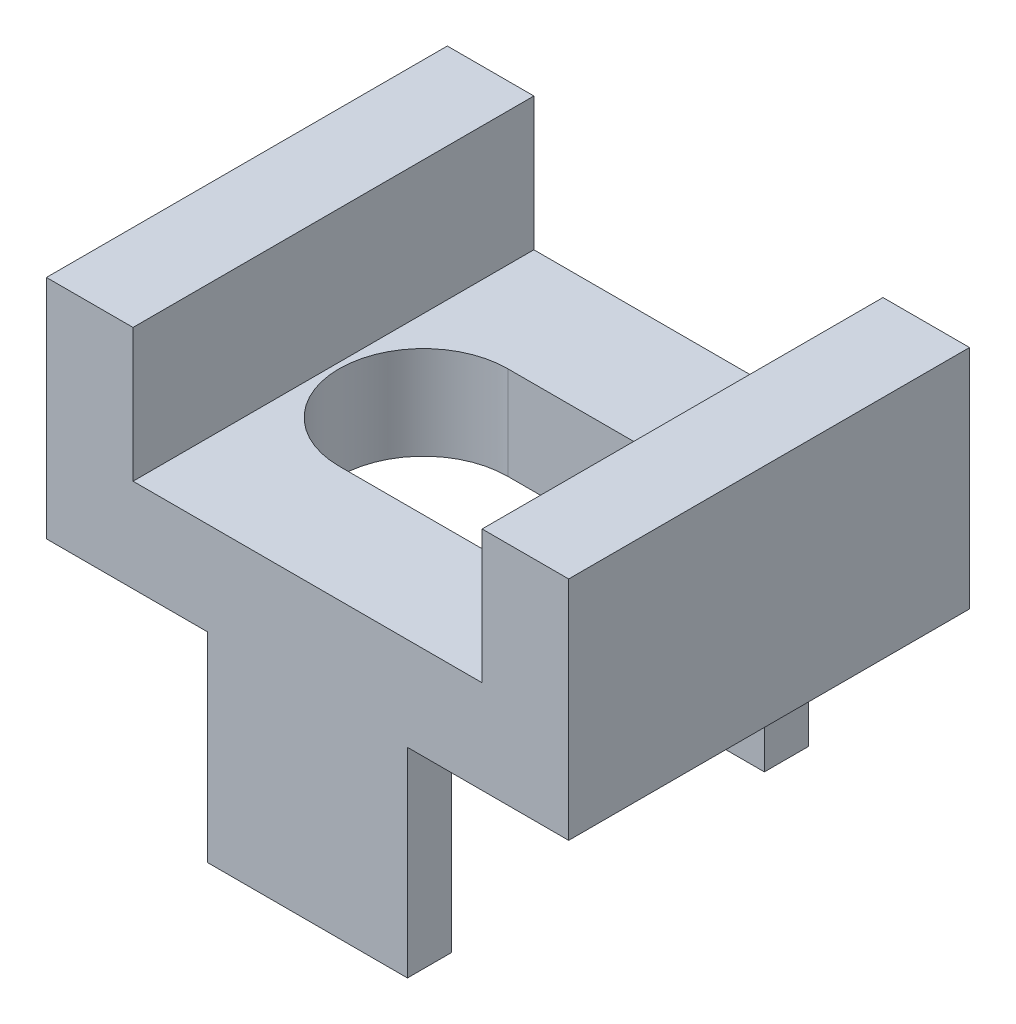
ISO-10303-21;
HEADER;
FILE_DESCRIPTION(('STEP AP214'),'2;1');
FILE_NAME('part.step','',(''),(''),'','','');
FILE_SCHEMA(('AUTOMOTIVE_DESIGN { 1 0 10303 214 1 1 1 1 }'));
ENDSEC;
DATA;
#1=APPLICATION_CONTEXT('core data for automotive mechanical design processes');
#2=APPLICATION_PROTOCOL_DEFINITION('international standard','automotive_design',2000,#1);
#3=PRODUCT_CONTEXT('',#1,'mechanical');
#4=PRODUCT('Part','Part','',(#3));
#5=PRODUCT_RELATED_PRODUCT_CATEGORY('part','',(#4));
#6=PRODUCT_DEFINITION_FORMATION('','',#4);
#7=PRODUCT_DEFINITION_CONTEXT('part definition',#1,'design');
#8=PRODUCT_DEFINITION('design','',#6,#7);
#9=PRODUCT_DEFINITION_SHAPE('','',#8);
#10=(LENGTH_UNIT() NAMED_UNIT(*) SI_UNIT(.MILLI.,.METRE.));
#11=(NAMED_UNIT(*) PLANE_ANGLE_UNIT() SI_UNIT($,.RADIAN.));
#12=(NAMED_UNIT(*) SI_UNIT($,.STERADIAN.) SOLID_ANGLE_UNIT());
#13=UNCERTAINTY_MEASURE_WITH_UNIT(LENGTH_MEASURE(1.E-05),#10,'distance_accuracy_value','');
#14=(GEOMETRIC_REPRESENTATION_CONTEXT(3) GLOBAL_UNCERTAINTY_ASSIGNED_CONTEXT((#13)) GLOBAL_UNIT_ASSIGNED_CONTEXT((#10,
#11,#12)) REPRESENTATION_CONTEXT('',''));
#15=CARTESIAN_POINT('',(0.,0.,0.));
#16=DIRECTION('',(0.,0.,1.));
#17=DIRECTION('',(1.,0.,0.));
#18=AXIS2_PLACEMENT_3D('',#15,#16,#17);
#19=CARTESIAN_POINT('',(0.,15.9179465383006,0.));
#20=DIRECTION('',(0.,-1.,0.));
#21=DIRECTION('',(0.,0.,-1.));
#22=AXIS2_PLACEMENT_3D('',#19,#20,#21);
#23=PLANE('',#22);
#24=CARTESIAN_POINT('',(-29.7422861966929,15.9179465383006,1.76446459703365));
#25=DIRECTION('',(0.,1.,0.));
#26=DIRECTION('',(-1.,0.,0.));
#27=AXIS2_PLACEMENT_3D('',#24,#25,#26);
#28=CIRCLE('',#27,0.633400000000021);
#29=CARTESIAN_POINT('',(-29.7422861966929,15.9179465383006,1.13106459703361));
#30=VERTEX_POINT('',#29);
#31=CARTESIAN_POINT('',(-29.7422861966929,15.9179465383006,2.39786459703365));
#32=VERTEX_POINT('',#31);
#33=EDGE_CURVE('E287',#30,#32,#28,.T.);
#34=ORIENTED_EDGE('',*,*,#33,.F.);
#35=DIRECTION('',(-1.,0.,0.));
#36=VECTOR('',#35,1.);
#37=CARTESIAN_POINT('',(-29.7422861966929,15.9179465383006,1.13106459703361));
#38=LINE('',#37,#36);
#39=CARTESIAN_POINT('',(-28.4722861966929,15.9179465383006,1.13106459703361));
#40=VERTEX_POINT('',#39);
#41=EDGE_CURVE('E295',#40,#30,#38,.T.);
#42=ORIENTED_EDGE('',*,*,#41,.F.);
#43=CARTESIAN_POINT('',(-28.4722861966929,15.9179465383006,1.76446459703363));
#44=DIRECTION('',(0.,1.,0.));
#45=DIRECTION('',(-1.,0.,0.));
#46=AXIS2_PLACEMENT_3D('',#43,#44,#45);
#47=CIRCLE('',#46,0.633400000000021);
#48=CARTESIAN_POINT('',(-28.4722861966929,15.9179465383006,2.39786459703365));
#49=VERTEX_POINT('',#48);
#50=EDGE_CURVE('E292',#49,#40,#47,.T.);
#51=ORIENTED_EDGE('',*,*,#50,.F.);
#52=DIRECTION('',(1.,0.,0.));
#53=VECTOR('',#52,1.);
#54=CARTESIAN_POINT('',(-29.7422861966929,15.9179465383006,2.39786459703365));
#55=LINE('',#54,#53);
#56=EDGE_CURVE('E289',#32,#49,#55,.T.);
#57=ORIENTED_EDGE('',*,*,#56,.F.);
#58=EDGE_LOOP('',(#34,#42,#51,#57));
#59=FACE_BOUND('',#58,.T.);
#60=DIRECTION('',(-1.,0.,0.));
#61=VECTOR('',#60,1.);
#62=CARTESIAN_POINT('',(-31.0677861966929,15.9179465383006,0.259564597033629));
#63=LINE('',#62,#61);
#64=CARTESIAN_POINT('',(-27.7967861966929,15.9179465383006,0.259564597033629));
#65=VERTEX_POINT('',#64);
#66=CARTESIAN_POINT('',(-30.4177861966929,15.9179465383006,0.259564597033629));
#67=VERTEX_POINT('',#66);
#68=EDGE_CURVE('E57',#65,#67,#63,.T.);
#69=ORIENTED_EDGE('',*,*,#68,.T.);
#70=DIRECTION('',(0.,0.,1.));
#71=VECTOR('',#70,1.);
#72=CARTESIAN_POINT('',(-30.4177861966929,15.9179465383006,0.259564597033629));
#73=LINE('',#72,#71);
#74=CARTESIAN_POINT('',(-30.4177861966929,15.9179465383006,3.26936459703363));
#75=VERTEX_POINT('',#74);
#76=EDGE_CURVE('E52',#67,#75,#73,.T.);
#77=ORIENTED_EDGE('',*,*,#76,.T.);
#78=DIRECTION('',(1.,0.,0.));
#79=VECTOR('',#78,1.);
#80=CARTESIAN_POINT('',(-31.0677861966929,15.9179465383006,3.26936459703363));
#81=LINE('',#80,#79);
#82=CARTESIAN_POINT('',(-27.7967861966929,15.9179465383006,3.26936459703363));
#83=VERTEX_POINT('',#82);
#84=EDGE_CURVE('E318',#75,#83,#81,.T.);
#85=ORIENTED_EDGE('',*,*,#84,.T.);
#86=DIRECTION('',(0.,0.,1.));
#87=VECTOR('',#86,1.);
#88=CARTESIAN_POINT('',(-27.7967861966929,15.9179465383006,0.259564597033629));
#89=LINE('',#88,#87);
#90=EDGE_CURVE('E206',#65,#83,#89,.T.);
#91=ORIENTED_EDGE('',*,*,#90,.F.);
#92=EDGE_LOOP('',(#69,#77,#85,#91));
#93=FACE_BOUND('',#92,.T.);
#94=ADVANCED_FACE('F37',(#59,#93),#23,.F.);
#95=CARTESIAN_POINT('',(0.,15.2179465383006,0.));
#96=DIRECTION('',(0.,-1.,0.));
#97=DIRECTION('',(0.,0.,-1.));
#98=AXIS2_PLACEMENT_3D('',#95,#96,#97);
#99=PLANE('',#98);
#100=DIRECTION('',(1.,0.,0.));
#101=VECTOR('',#100,1.);
#102=CARTESIAN_POINT('',(-29.1072861966929,15.2179465383006,2.93936459703363));
#103=LINE('',#102,#101);
#104=CARTESIAN_POINT('',(-29.8572861966929,15.2179465383006,2.93936459703363));
#105=VERTEX_POINT('',#104);
#106=CARTESIAN_POINT('',(-28.3572861966929,15.2179465383006,2.93936459703363));
#107=VERTEX_POINT('',#106);
#108=EDGE_CURVE('E266',#105,#107,#103,.T.);
#109=ORIENTED_EDGE('',*,*,#108,.F.);
#110=DIRECTION('',(0.,0.,1.));
#111=VECTOR('',#110,1.);
#112=CARTESIAN_POINT('',(-29.8572861966929,15.2179465383006,2.93936459703363));
#113=LINE('',#112,#111);
#114=CARTESIAN_POINT('',(-29.8572861966929,15.2179465383006,3.26936459703363));
#115=VERTEX_POINT('',#114);
#116=EDGE_CURVE('E226',#105,#115,#113,.T.);
#117=ORIENTED_EDGE('',*,*,#116,.T.);
#118=DIRECTION('',(1.,0.,0.));
#119=VECTOR('',#118,1.);
#120=CARTESIAN_POINT('',(-31.0677861966929,15.2179465383006,3.26936459703363));
#121=LINE('',#120,#119);
#122=CARTESIAN_POINT('',(-31.0677861966929,15.2179465383006,3.26936459703363));
#123=VERTEX_POINT('',#122);
#124=EDGE_CURVE('E322',#123,#115,#121,.T.);
#125=ORIENTED_EDGE('',*,*,#124,.F.);
#126=DIRECTION('',(0.,0.,1.));
#127=VECTOR('',#126,1.);
#128=CARTESIAN_POINT('',(-31.0677861966929,15.2179465383006,0.259564597033629));
#129=LINE('',#128,#127);
#130=CARTESIAN_POINT('',(-31.0677861966929,15.2179465383006,0.259564597033629));
#131=VERTEX_POINT('',#130);
#132=EDGE_CURVE('E320',#131,#123,#129,.T.);
#133=ORIENTED_EDGE('',*,*,#132,.F.);
#134=DIRECTION('',(-1.,0.,0.));
#135=VECTOR('',#134,1.);
#136=CARTESIAN_POINT('',(-31.0677861966929,15.2179465383006,0.259564597033629));
#137=LINE('',#136,#135);
#138=CARTESIAN_POINT('',(-29.8572861966929,15.2179465383006,0.259564597033629));
#139=VERTEX_POINT('',#138);
#140=EDGE_CURVE('E180',#139,#131,#137,.T.);
#141=ORIENTED_EDGE('',*,*,#140,.F.);
#142=DIRECTION('',(0.,0.,-1.));
#143=VECTOR('',#142,1.);
#144=CARTESIAN_POINT('',(-29.8572861966929,15.2179465383006,0.589564597033626));
#145=LINE('',#144,#143);
#146=CARTESIAN_POINT('',(-29.8572861966929,15.2179465383006,0.589564597033626));
#147=VERTEX_POINT('',#146);
#148=EDGE_CURVE('E237',#147,#139,#145,.T.);
#149=ORIENTED_EDGE('',*,*,#148,.F.);
#150=DIRECTION('',(1.,0.,0.));
#151=VECTOR('',#150,1.);
#152=CARTESIAN_POINT('',(-29.1072861966929,15.2179465383006,0.589564597033626));
#153=LINE('',#152,#151);
#154=CARTESIAN_POINT('',(-28.3572861966929,15.2179465383006,0.589564597033626));
#155=VERTEX_POINT('',#154);
#156=EDGE_CURVE('E248',#147,#155,#153,.T.);
#157=ORIENTED_EDGE('',*,*,#156,.T.);
#158=DIRECTION('',(0.,0.,-1.));
#159=VECTOR('',#158,1.);
#160=CARTESIAN_POINT('',(-28.3572861966929,15.2179465383006,0.589564597033626));
#161=LINE('',#160,#159);
#162=CARTESIAN_POINT('',(-28.3572861966929,15.2179465383006,0.259564597033629));
#163=VERTEX_POINT('',#162);
#164=EDGE_CURVE('E253',#155,#163,#161,.T.);
#165=ORIENTED_EDGE('',*,*,#164,.T.);
#166=CARTESIAN_POINT('',(-27.1467861966929,15.2179465383006,0.259564597033629));
#167=VERTEX_POINT('',#166);
#168=EDGE_CURVE('E327',#167,#163,#137,.T.);
#169=ORIENTED_EDGE('',*,*,#168,.F.);
#170=DIRECTION('',(0.,0.,-1.));
#171=VECTOR('',#170,1.);
#172=CARTESIAN_POINT('',(-27.1467861966929,15.2179465383006,0.259564597033629));
#173=LINE('',#172,#171);
#174=CARTESIAN_POINT('',(-27.1467861966929,15.2179465383006,3.26936459703363));
#175=VERTEX_POINT('',#174);
#176=EDGE_CURVE('E325',#175,#167,#173,.T.);
#177=ORIENTED_EDGE('',*,*,#176,.F.);
#178=CARTESIAN_POINT('',(-28.3572861966929,15.2179465383006,3.26936459703363));
#179=VERTEX_POINT('',#178);
#180=EDGE_CURVE('E317',#179,#175,#121,.T.);
#181=ORIENTED_EDGE('',*,*,#180,.F.);
#182=DIRECTION('',(0.,0.,1.));
#183=VECTOR('',#182,1.);
#184=CARTESIAN_POINT('',(-28.3572861966929,15.2179465383006,2.93936459703363));
#185=LINE('',#184,#183);
#186=EDGE_CURVE('E271',#107,#179,#185,.T.);
#187=ORIENTED_EDGE('',*,*,#186,.F.);
#188=EDGE_LOOP('',(#109,#117,#125,#133,#141,#149,#157,#165,#169,#177,#181,#187));
#189=FACE_BOUND('',#188,.T.);
#190=DIRECTION('',(-1.,0.,0.));
#191=VECTOR('',#190,1.);
#192=CARTESIAN_POINT('',(-29.7422861966929,15.2179465383006,1.13106459703361));
#193=LINE('',#192,#191);
#194=CARTESIAN_POINT('',(-28.4722861966929,15.2179465383006,1.13106459703361));
#195=VERTEX_POINT('',#194);
#196=CARTESIAN_POINT('',(-29.7422861966929,15.2179465383006,1.13106459703361));
#197=VERTEX_POINT('',#196);
#198=EDGE_CURVE('E290',#195,#197,#193,.T.);
#199=ORIENTED_EDGE('',*,*,#198,.T.);
#200=CARTESIAN_POINT('',(-29.7422861966929,15.2179465383006,1.76446459703365));
#201=DIRECTION('',(0.,1.,0.));
#202=DIRECTION('',(-1.,0.,0.));
#203=AXIS2_PLACEMENT_3D('',#200,#201,#202);
#204=CIRCLE('',#203,0.633400000000021);
#205=CARTESIAN_POINT('',(-29.7422861966929,15.2179465383006,2.39786459703365));
#206=VERTEX_POINT('',#205);
#207=EDGE_CURVE('E286',#197,#206,#204,.T.);
#208=ORIENTED_EDGE('',*,*,#207,.T.);
#209=DIRECTION('',(1.,0.,0.));
#210=VECTOR('',#209,1.);
#211=CARTESIAN_POINT('',(-29.7422861966929,15.2179465383006,2.39786459703365));
#212=LINE('',#211,#210);
#213=CARTESIAN_POINT('',(-28.4722861966929,15.2179465383006,2.39786459703365));
#214=VERTEX_POINT('',#213);
#215=EDGE_CURVE('E300',#206,#214,#212,.T.);
#216=ORIENTED_EDGE('',*,*,#215,.T.);
#217=CARTESIAN_POINT('',(-28.4722861966929,15.2179465383006,1.76446459703363));
#218=DIRECTION('',(0.,1.,0.));
#219=DIRECTION('',(-1.,0.,0.));
#220=AXIS2_PLACEMENT_3D('',#217,#218,#219);
#221=CIRCLE('',#220,0.633400000000021);
#222=EDGE_CURVE('E303',#214,#195,#221,.T.);
#223=ORIENTED_EDGE('',*,*,#222,.T.);
#224=EDGE_LOOP('',(#199,#208,#216,#223));
#225=FACE_BOUND('',#224,.T.);
#226=ADVANCED_FACE('F340',(#189,#225),#99,.T.);
#227=CARTESIAN_POINT('',(-31.0677861966929,15.9179465383006,3.26936459703363));
#228=DIRECTION('',(0.,0.,-1.));
#229=DIRECTION('',(0.,1.,0.));
#230=AXIS2_PLACEMENT_3D('',#227,#228,#229);
#231=PLANE('',#230);
#232=ORIENTED_EDGE('',*,*,#124,.T.);
#233=DIRECTION('',(0.,1.,0.));
#234=VECTOR('',#233,1.);
#235=CARTESIAN_POINT('',(-29.8572861966929,13.7179465383006,3.26936459703363));
#236=LINE('',#235,#234);
#237=CARTESIAN_POINT('',(-29.8572861966929,13.7179465383006,3.26936459703363));
#238=VERTEX_POINT('',#237);
#239=EDGE_CURVE('E234',#238,#115,#236,.T.);
#240=ORIENTED_EDGE('',*,*,#239,.F.);
#241=DIRECTION('',(1.,0.,0.));
#242=VECTOR('',#241,1.);
#243=CARTESIAN_POINT('',(-29.1072861966929,13.7179465383006,3.26936459703363));
#244=LINE('',#243,#242);
#245=CARTESIAN_POINT('',(-28.3572861966929,13.7179465383006,3.26936459703363));
#246=VERTEX_POINT('',#245);
#247=EDGE_CURVE('E273',#238,#246,#244,.T.);
#248=ORIENTED_EDGE('',*,*,#247,.T.);
#249=DIRECTION('',(0.,1.,0.));
#250=VECTOR('',#249,1.);
#251=CARTESIAN_POINT('',(-28.3572861966929,13.7179465383006,3.26936459703363));
#252=LINE('',#251,#250);
#253=EDGE_CURVE('E276',#246,#179,#252,.T.);
#254=ORIENTED_EDGE('',*,*,#253,.T.);
#255=ORIENTED_EDGE('',*,*,#180,.T.);
#256=DIRECTION('',(0.,-1.,0.));
#257=VECTOR('',#256,1.);
#258=CARTESIAN_POINT('',(-27.1467861966929,15.9179465383006,3.26936459703363));
#259=LINE('',#258,#257);
#260=CARTESIAN_POINT('',(-27.1467861966929,16.9179465383006,3.26936459703363));
#261=VERTEX_POINT('',#260);
#262=EDGE_CURVE('E11',#261,#175,#259,.T.);
#263=ORIENTED_EDGE('',*,*,#262,.F.);
#264=DIRECTION('',(-1.,0.,0.));
#265=VECTOR('',#264,1.);
#266=CARTESIAN_POINT('',(-27.1467861966929,16.9179465383006,3.26936459703363));
#267=LINE('',#266,#265);
#268=CARTESIAN_POINT('',(-27.7967861966929,16.9179465383006,3.26936459703363));
#269=VERTEX_POINT('',#268);
#270=EDGE_CURVE('E212',#261,#269,#267,.T.);
#271=ORIENTED_EDGE('',*,*,#270,.T.);
#272=DIRECTION('',(0.,-1.,0.));
#273=VECTOR('',#272,1.);
#274=CARTESIAN_POINT('',(-27.7967861966929,16.9179465383006,3.26936459703363));
#275=LINE('',#274,#273);
#276=EDGE_CURVE('E218',#269,#83,#275,.T.);
#277=ORIENTED_EDGE('',*,*,#276,.T.);
#278=ORIENTED_EDGE('',*,*,#84,.F.);
#279=DIRECTION('',(0.,-1.,0.));
#280=VECTOR('',#279,1.);
#281=CARTESIAN_POINT('',(-30.4177861966929,16.9179465383006,3.26936459703363));
#282=LINE('',#281,#280);
#283=CARTESIAN_POINT('',(-30.4177861966929,16.9179465383006,3.26936459703363));
#284=VERTEX_POINT('',#283);
#285=EDGE_CURVE('E203',#284,#75,#282,.T.);
#286=ORIENTED_EDGE('',*,*,#285,.F.);
#287=DIRECTION('',(1.,0.,0.));
#288=VECTOR('',#287,1.);
#289=CARTESIAN_POINT('',(-31.0677861966929,16.9179465383006,3.26936459703363));
#290=LINE('',#289,#288);
#291=CARTESIAN_POINT('',(-31.0677861966929,16.9179465383006,3.26936459703363));
#292=VERTEX_POINT('',#291);
#293=EDGE_CURVE('E191',#292,#284,#290,.T.);
#294=ORIENTED_EDGE('',*,*,#293,.F.);
#295=DIRECTION('',(0.,-1.,0.));
#296=VECTOR('',#295,1.);
#297=CARTESIAN_POINT('',(-31.0677861966929,15.9179465383006,3.26936459703363));
#298=LINE('',#297,#296);
#299=EDGE_CURVE('E183',#292,#123,#298,.T.);
#300=ORIENTED_EDGE('',*,*,#299,.T.);
#301=EDGE_LOOP('',(#232,#240,#248,#254,#255,#263,#271,#277,#278,#286,#294,#300));
#302=FACE_BOUND('',#301,.T.);
#303=ADVANCED_FACE('F39',(#302),#231,.F.);
#304=CARTESIAN_POINT('',(-27.1467861966929,15.9179465383006,0.259564597033629));
#305=DIRECTION('',(-1.,0.,0.));
#306=DIRECTION('',(0.,-1.,0.));
#307=AXIS2_PLACEMENT_3D('',#304,#305,#306);
#308=PLANE('',#307);
#309=ORIENTED_EDGE('',*,*,#176,.T.);
#310=DIRECTION('',(0.,-1.,0.));
#311=VECTOR('',#310,1.);
#312=CARTESIAN_POINT('',(-27.1467861966929,15.9179465383006,0.259564597033629));
#313=LINE('',#312,#311);
#314=CARTESIAN_POINT('',(-27.1467861966929,16.9179465383006,0.259564597033629));
#315=VERTEX_POINT('',#314);
#316=EDGE_CURVE('E45',#315,#167,#313,.T.);
#317=ORIENTED_EDGE('',*,*,#316,.F.);
#318=DIRECTION('',(0.,0.,1.));
#319=VECTOR('',#318,1.);
#320=CARTESIAN_POINT('',(-27.1467861966929,16.9179465383006,0.259564597033629));
#321=LINE('',#320,#319);
#322=EDGE_CURVE('E215',#315,#261,#321,.T.);
#323=ORIENTED_EDGE('',*,*,#322,.T.);
#324=ORIENTED_EDGE('',*,*,#262,.T.);
#325=EDGE_LOOP('',(#309,#317,#323,#324));
#326=FACE_BOUND('',#325,.T.);
#327=ADVANCED_FACE('F366',(#326),#308,.F.);
#328=CARTESIAN_POINT('',(-31.0677861966929,15.9179465383006,0.259564597033629));
#329=DIRECTION('',(0.,0.,1.));
#330=DIRECTION('',(0.,-1.,0.));
#331=AXIS2_PLACEMENT_3D('',#328,#329,#330);
#332=PLANE('',#331);
#333=DIRECTION('',(0.,1.,0.));
#334=VECTOR('',#333,1.);
#335=CARTESIAN_POINT('',(-29.8572861966929,13.7179465383006,0.259564597033629));
#336=LINE('',#335,#334);
#337=CARTESIAN_POINT('',(-29.8572861966929,13.7179465383006,0.259564597033629));
#338=VERTEX_POINT('',#337);
#339=EDGE_CURVE('E241',#338,#139,#336,.T.);
#340=ORIENTED_EDGE('',*,*,#339,.T.);
#341=ORIENTED_EDGE('',*,*,#140,.T.);
#342=DIRECTION('',(0.,-1.,0.));
#343=VECTOR('',#342,1.);
#344=CARTESIAN_POINT('',(-31.0677861966929,15.9179465383006,0.259564597033629));
#345=LINE('',#344,#343);
#346=CARTESIAN_POINT('',(-31.0677861966929,16.9179465383006,0.259564597033629));
#347=VERTEX_POINT('',#346);
#348=EDGE_CURVE('E173',#347,#131,#345,.T.);
#349=ORIENTED_EDGE('',*,*,#348,.F.);
#350=DIRECTION('',(1.,0.,0.));
#351=VECTOR('',#350,1.);
#352=CARTESIAN_POINT('',(-31.0677861966929,16.9179465383006,0.259564597033629));
#353=LINE('',#352,#351);
#354=CARTESIAN_POINT('',(-30.4177861966929,16.9179465383006,0.259564597033629));
#355=VERTEX_POINT('',#354);
#356=EDGE_CURVE('E177',#347,#355,#353,.T.);
#357=ORIENTED_EDGE('',*,*,#356,.T.);
#358=DIRECTION('',(0.,-1.,0.));
#359=VECTOR('',#358,1.);
#360=CARTESIAN_POINT('',(-30.4177861966929,16.9179465383006,0.259564597033629));
#361=LINE('',#360,#359);
#362=EDGE_CURVE('E200',#355,#67,#361,.T.);
#363=ORIENTED_EDGE('',*,*,#362,.T.);
#364=ORIENTED_EDGE('',*,*,#68,.F.);
#365=DIRECTION('',(0.,-1.,0.));
#366=VECTOR('',#365,1.);
#367=CARTESIAN_POINT('',(-27.7967861966929,16.9179465383006,0.259564597033629));
#368=LINE('',#367,#366);
#369=CARTESIAN_POINT('',(-27.7967861966929,16.9179465383006,0.259564597033629));
#370=VERTEX_POINT('',#369);
#371=EDGE_CURVE('E223',#370,#65,#368,.T.);
#372=ORIENTED_EDGE('',*,*,#371,.F.);
#373=DIRECTION('',(-1.,0.,0.));
#374=VECTOR('',#373,1.);
#375=CARTESIAN_POINT('',(-27.1467861966929,16.9179465383006,0.259564597033629));
#376=LINE('',#375,#374);
#377=EDGE_CURVE('E207',#315,#370,#376,.T.);
#378=ORIENTED_EDGE('',*,*,#377,.F.);
#379=ORIENTED_EDGE('',*,*,#316,.T.);
#380=ORIENTED_EDGE('',*,*,#168,.T.);
#381=DIRECTION('',(0.,1.,0.));
#382=VECTOR('',#381,1.);
#383=CARTESIAN_POINT('',(-28.3572861966929,13.7179465383006,0.259564597033629));
#384=LINE('',#383,#382);
#385=CARTESIAN_POINT('',(-28.3572861966929,13.7179465383006,0.259564597033629));
#386=VERTEX_POINT('',#385);
#387=EDGE_CURVE('E264',#386,#163,#384,.T.);
#388=ORIENTED_EDGE('',*,*,#387,.F.);
#389=DIRECTION('',(1.,0.,0.));
#390=VECTOR('',#389,1.);
#391=CARTESIAN_POINT('',(-29.1072861966929,13.7179465383006,0.259564597033629));
#392=LINE('',#391,#390);
#393=EDGE_CURVE('E252',#338,#386,#392,.T.);
#394=ORIENTED_EDGE('',*,*,#393,.F.);
#395=EDGE_LOOP('',(#340,#341,#349,#357,#363,#364,#372,#378,#379,#380,#388,#394));
#396=FACE_BOUND('',#395,.T.);
#397=ADVANCED_FACE('F175',(#396),#332,.F.);
#398=CARTESIAN_POINT('',(-31.0677861966929,15.9179465383006,0.259564597033629));
#399=DIRECTION('',(1.,0.,0.));
#400=DIRECTION('',(0.,1.,0.));
#401=AXIS2_PLACEMENT_3D('',#398,#399,#400);
#402=PLANE('',#401);
#403=ORIENTED_EDGE('',*,*,#132,.T.);
#404=ORIENTED_EDGE('',*,*,#299,.F.);
#405=DIRECTION('',(0.,0.,1.));
#406=VECTOR('',#405,1.);
#407=CARTESIAN_POINT('',(-31.0677861966929,16.9179465383006,0.259564597033629));
#408=LINE('',#407,#406);
#409=EDGE_CURVE('E186',#347,#292,#408,.T.);
#410=ORIENTED_EDGE('',*,*,#409,.F.);
#411=ORIENTED_EDGE('',*,*,#348,.T.);
#412=EDGE_LOOP('',(#403,#404,#410,#411));
#413=FACE_BOUND('',#412,.T.);
#414=ADVANCED_FACE('F187',(#413),#402,.F.);
#415=CARTESIAN_POINT('',(-29.7422861966929,15.9179465383006,1.76446459703365));
#416=DIRECTION('',(0.,-1.,0.));
#417=DIRECTION('',(1.,0.,0.));
#418=AXIS2_PLACEMENT_3D('',#415,#416,#417);
#419=CYLINDRICAL_SURFACE('',#418,0.633400000000021);
#420=ORIENTED_EDGE('',*,*,#207,.F.);
#421=DIRECTION('',(0.,-1.,0.));
#422=VECTOR('',#421,1.);
#423=CARTESIAN_POINT('',(-29.7422861966929,15.9179465383006,1.13106459703361));
#424=LINE('',#423,#422);
#425=EDGE_CURVE('E297',#30,#197,#424,.T.);
#426=ORIENTED_EDGE('',*,*,#425,.F.);
#427=ORIENTED_EDGE('',*,*,#33,.T.);
#428=DIRECTION('',(0.,-1.,0.));
#429=VECTOR('',#428,1.);
#430=CARTESIAN_POINT('',(-29.7422861966929,15.9179465383006,2.39786459703365));
#431=LINE('',#430,#429);
#432=EDGE_CURVE('E314',#32,#206,#431,.T.);
#433=ORIENTED_EDGE('',*,*,#432,.T.);
#434=EDGE_LOOP('',(#420,#426,#427,#433));
#435=FACE_BOUND('',#434,.T.);
#436=ADVANCED_FACE('F399',(#435),#419,.F.);
#437=CARTESIAN_POINT('',(-29.7422861966929,15.9179465383006,2.39786459703365));
#438=DIRECTION('',(0.,0.,-1.));
#439=DIRECTION('',(0.,1.,0.));
#440=AXIS2_PLACEMENT_3D('',#437,#438,#439);
#441=PLANE('',#440);
#442=ORIENTED_EDGE('',*,*,#215,.F.);
#443=ORIENTED_EDGE('',*,*,#432,.F.);
#444=ORIENTED_EDGE('',*,*,#56,.T.);
#445=DIRECTION('',(0.,-1.,0.));
#446=VECTOR('',#445,1.);
#447=CARTESIAN_POINT('',(-28.4722861966929,15.9179465383006,2.39786459703365));
#448=LINE('',#447,#446);
#449=EDGE_CURVE('E312',#49,#214,#448,.T.);
#450=ORIENTED_EDGE('',*,*,#449,.T.);
#451=EDGE_LOOP('',(#442,#443,#444,#450));
#452=FACE_BOUND('',#451,.T.);
#453=ADVANCED_FACE('F608',(#452),#441,.T.);
#454=CARTESIAN_POINT('',(-28.4722861966929,15.9179465383006,1.76446459703363));
#455=DIRECTION('',(0.,-1.,0.));
#456=DIRECTION('',(1.,0.,0.));
#457=AXIS2_PLACEMENT_3D('',#454,#455,#456);
#458=CYLINDRICAL_SURFACE('',#457,0.633400000000021);
#459=ORIENTED_EDGE('',*,*,#222,.F.);
#460=ORIENTED_EDGE('',*,*,#449,.F.);
#461=ORIENTED_EDGE('',*,*,#50,.T.);
#462=DIRECTION('',(0.,-1.,0.));
#463=VECTOR('',#462,1.);
#464=CARTESIAN_POINT('',(-28.4722861966929,15.9179465383006,1.13106459703361));
#465=LINE('',#464,#463);
#466=EDGE_CURVE('E310',#40,#195,#465,.T.);
#467=ORIENTED_EDGE('',*,*,#466,.T.);
#468=EDGE_LOOP('',(#459,#460,#461,#467));
#469=FACE_BOUND('',#468,.T.);
#470=ADVANCED_FACE('F598',(#469),#458,.F.);
#471=CARTESIAN_POINT('',(-29.7422861966929,15.9179465383006,1.13106459703361));
#472=DIRECTION('',(0.,0.,1.));
#473=DIRECTION('',(0.,-1.,0.));
#474=AXIS2_PLACEMENT_3D('',#471,#472,#473);
#475=PLANE('',#474);
#476=ORIENTED_EDGE('',*,*,#198,.F.);
#477=ORIENTED_EDGE('',*,*,#466,.F.);
#478=ORIENTED_EDGE('',*,*,#41,.T.);
#479=ORIENTED_EDGE('',*,*,#425,.T.);
#480=EDGE_LOOP('',(#476,#477,#478,#479));
#481=FACE_BOUND('',#480,.T.);
#482=ADVANCED_FACE('F431',(#481),#475,.T.);
#483=CARTESIAN_POINT('',(-29.1072861966929,13.7179465383006,2.93936459703363));
#484=DIRECTION('',(0.,0.,1.));
#485=DIRECTION('',(1.,0.,0.));
#486=AXIS2_PLACEMENT_3D('',#483,#484,#485);
#487=PLANE('',#486);
#488=ORIENTED_EDGE('',*,*,#108,.T.);
#489=DIRECTION('',(0.,1.,0.));
#490=VECTOR('',#489,1.);
#491=CARTESIAN_POINT('',(-28.3572861966929,13.7179465383006,2.93936459703363));
#492=LINE('',#491,#490);
#493=CARTESIAN_POINT('',(-28.3572861966929,13.7179465383006,2.93936459703363));
#494=VERTEX_POINT('',#493);
#495=EDGE_CURVE('E283',#494,#107,#492,.T.);
#496=ORIENTED_EDGE('',*,*,#495,.F.);
#497=DIRECTION('',(1.,0.,0.));
#498=VECTOR('',#497,1.);
#499=CARTESIAN_POINT('',(-29.1072861966929,13.7179465383006,2.93936459703363));
#500=LINE('',#499,#498);
#501=CARTESIAN_POINT('',(-29.8572861966929,13.7179465383006,2.93936459703363));
#502=VERTEX_POINT('',#501);
#503=EDGE_CURVE('E267',#502,#494,#500,.T.);
#504=ORIENTED_EDGE('',*,*,#503,.F.);
#505=DIRECTION('',(0.,1.,0.));
#506=VECTOR('',#505,1.);
#507=CARTESIAN_POINT('',(-29.8572861966929,13.7179465383006,2.93936459703363));
#508=LINE('',#507,#506);
#509=EDGE_CURVE('E230',#502,#105,#508,.T.);
#510=ORIENTED_EDGE('',*,*,#509,.T.);
#511=EDGE_LOOP('',(#488,#496,#504,#510));
#512=FACE_BOUND('',#511,.T.);
#513=ADVANCED_FACE('F372',(#512),#487,.F.);
#514=CARTESIAN_POINT('',(-28.3572861966929,13.7179465383006,2.93936459703363));
#515=DIRECTION('',(-1.,0.,0.));
#516=DIRECTION('',(0.,-1.,0.));
#517=AXIS2_PLACEMENT_3D('',#514,#515,#516);
#518=PLANE('',#517);
#519=ORIENTED_EDGE('',*,*,#186,.T.);
#520=ORIENTED_EDGE('',*,*,#253,.F.);
#521=DIRECTION('',(0.,0.,1.));
#522=VECTOR('',#521,1.);
#523=CARTESIAN_POINT('',(-28.3572861966929,13.7179465383006,2.93936459703363));
#524=LINE('',#523,#522);
#525=EDGE_CURVE('E270',#494,#246,#524,.T.);
#526=ORIENTED_EDGE('',*,*,#525,.F.);
#527=ORIENTED_EDGE('',*,*,#495,.T.);
#528=EDGE_LOOP('',(#519,#520,#526,#527));
#529=FACE_BOUND('',#528,.T.);
#530=ADVANCED_FACE('F370',(#529),#518,.F.);
#531=CARTESIAN_POINT('',(0.,13.7179465383006,0.));
#532=DIRECTION('',(0.,-1.,0.));
#533=DIRECTION('',(0.,0.,-1.));
#534=AXIS2_PLACEMENT_3D('',#531,#532,#533);
#535=PLANE('',#534);
#536=ORIENTED_EDGE('',*,*,#503,.T.);
#537=ORIENTED_EDGE('',*,*,#525,.T.);
#538=ORIENTED_EDGE('',*,*,#247,.F.);
#539=DIRECTION('',(0.,0.,1.));
#540=VECTOR('',#539,1.);
#541=CARTESIAN_POINT('',(-29.8572861966929,13.7179465383006,2.93936459703363));
#542=LINE('',#541,#540);
#543=EDGE_CURVE('E227',#502,#238,#542,.T.);
#544=ORIENTED_EDGE('',*,*,#543,.F.);
#545=EDGE_LOOP('',(#536,#537,#538,#544));
#546=FACE_BOUND('',#545,.T.);
#547=ADVANCED_FACE('F379',(#546),#535,.T.);
#548=CARTESIAN_POINT('',(-29.1072861966929,13.7179465383006,0.589564597033626));
#549=DIRECTION('',(0.,0.,1.));
#550=DIRECTION('',(1.,0.,0.));
#551=AXIS2_PLACEMENT_3D('',#548,#549,#550);
#552=PLANE('',#551);
#553=ORIENTED_EDGE('',*,*,#156,.F.);
#554=DIRECTION('',(0.,1.,0.));
#555=VECTOR('',#554,1.);
#556=CARTESIAN_POINT('',(-29.8572861966929,13.7179465383006,0.589564597033626));
#557=LINE('',#556,#555);
#558=CARTESIAN_POINT('',(-29.8572861966929,13.7179465383006,0.589564597033626));
#559=VERTEX_POINT('',#558);
#560=EDGE_CURVE('E245',#559,#147,#557,.T.);
#561=ORIENTED_EDGE('',*,*,#560,.F.);
#562=DIRECTION('',(1.,0.,0.));
#563=VECTOR('',#562,1.);
#564=CARTESIAN_POINT('',(-29.1072861966929,13.7179465383006,0.589564597033626));
#565=LINE('',#564,#563);
#566=CARTESIAN_POINT('',(-28.3572861966929,13.7179465383006,0.589564597033626));
#567=VERTEX_POINT('',#566);
#568=EDGE_CURVE('E249',#559,#567,#565,.T.);
#569=ORIENTED_EDGE('',*,*,#568,.T.);
#570=DIRECTION('',(0.,1.,0.));
#571=VECTOR('',#570,1.);
#572=CARTESIAN_POINT('',(-28.3572861966929,13.7179465383006,0.589564597033626));
#573=LINE('',#572,#571);
#574=EDGE_CURVE('E258',#567,#155,#573,.T.);
#575=ORIENTED_EDGE('',*,*,#574,.T.);
#576=EDGE_LOOP('',(#553,#561,#569,#575));
#577=FACE_BOUND('',#576,.T.);
#578=ADVANCED_FACE('F381',(#577),#552,.T.);
#579=CARTESIAN_POINT('',(-28.3572861966929,13.7179465383006,0.589564597033626));
#580=DIRECTION('',(1.,0.,0.));
#581=DIRECTION('',(0.,1.,0.));
#582=AXIS2_PLACEMENT_3D('',#579,#580,#581);
#583=PLANE('',#582);
#584=ORIENTED_EDGE('',*,*,#164,.F.);
#585=ORIENTED_EDGE('',*,*,#574,.F.);
#586=DIRECTION('',(0.,0.,-1.));
#587=VECTOR('',#586,1.);
#588=CARTESIAN_POINT('',(-28.3572861966929,13.7179465383006,0.589564597033626));
#589=LINE('',#588,#587);
#590=EDGE_CURVE('E255',#567,#386,#589,.T.);
#591=ORIENTED_EDGE('',*,*,#590,.T.);
#592=ORIENTED_EDGE('',*,*,#387,.T.);
#593=EDGE_LOOP('',(#584,#585,#591,#592));
#594=FACE_BOUND('',#593,.T.);
#595=ADVANCED_FACE('F345',(#594),#583,.T.);
#596=CARTESIAN_POINT('',(0.,13.7179465383006,3.52892919406726));
#597=DIRECTION('',(0.,-1.,0.));
#598=DIRECTION('',(0.,0.,1.));
#599=AXIS2_PLACEMENT_3D('',#596,#597,#598);
#600=PLANE('',#599);
#601=ORIENTED_EDGE('',*,*,#568,.F.);
#602=DIRECTION('',(0.,0.,-1.));
#603=VECTOR('',#602,1.);
#604=CARTESIAN_POINT('',(-29.8572861966929,13.7179465383006,0.589564597033626));
#605=LINE('',#604,#603);
#606=EDGE_CURVE('E238',#559,#338,#605,.T.);
#607=ORIENTED_EDGE('',*,*,#606,.T.);
#608=ORIENTED_EDGE('',*,*,#393,.T.);
#609=ORIENTED_EDGE('',*,*,#590,.F.);
#610=EDGE_LOOP('',(#601,#607,#608,#609));
#611=FACE_BOUND('',#610,.T.);
#612=ADVANCED_FACE('F350',(#611),#600,.T.);
#613=CARTESIAN_POINT('',(-29.8572861966929,13.7179465383006,0.589564597033626));
#614=DIRECTION('',(1.,0.,0.));
#615=DIRECTION('',(0.,1.,0.));
#616=AXIS2_PLACEMENT_3D('',#613,#614,#615);
#617=PLANE('',#616);
#618=ORIENTED_EDGE('',*,*,#148,.T.);
#619=ORIENTED_EDGE('',*,*,#339,.F.);
#620=ORIENTED_EDGE('',*,*,#606,.F.);
#621=ORIENTED_EDGE('',*,*,#560,.T.);
#622=EDGE_LOOP('',(#618,#619,#620,#621));
#623=FACE_BOUND('',#622,.T.);
#624=ADVANCED_FACE('F353',(#623),#617,.F.);
#625=CARTESIAN_POINT('',(-29.8572861966929,13.7179465383006,2.93936459703363));
#626=DIRECTION('',(-1.,0.,0.));
#627=DIRECTION('',(0.,-1.,0.));
#628=AXIS2_PLACEMENT_3D('',#625,#626,#627);
#629=PLANE('',#628);
#630=ORIENTED_EDGE('',*,*,#116,.F.);
#631=ORIENTED_EDGE('',*,*,#509,.F.);
#632=ORIENTED_EDGE('',*,*,#543,.T.);
#633=ORIENTED_EDGE('',*,*,#239,.T.);
#634=EDGE_LOOP('',(#630,#631,#632,#633));
#635=FACE_BOUND('',#634,.T.);
#636=ADVANCED_FACE('F377',(#635),#629,.T.);
#637=CARTESIAN_POINT('',(-27.7967861966929,16.9179465383006,0.259564597033629));
#638=DIRECTION('',(1.,0.,0.));
#639=DIRECTION('',(0.,1.,0.));
#640=AXIS2_PLACEMENT_3D('',#637,#638,#639);
#641=PLANE('',#640);
#642=ORIENTED_EDGE('',*,*,#90,.T.);
#643=ORIENTED_EDGE('',*,*,#276,.F.);
#644=DIRECTION('',(0.,0.,1.));
#645=VECTOR('',#644,1.);
#646=CARTESIAN_POINT('',(-27.7967861966929,16.9179465383006,0.259564597033629));
#647=LINE('',#646,#645);
#648=EDGE_CURVE('E210',#370,#269,#647,.T.);
#649=ORIENTED_EDGE('',*,*,#648,.F.);
#650=ORIENTED_EDGE('',*,*,#371,.T.);
#651=EDGE_LOOP('',(#642,#643,#649,#650));
#652=FACE_BOUND('',#651,.T.);
#653=ADVANCED_FACE('F361',(#652),#641,.F.);
#654=CARTESIAN_POINT('',(0.,16.9179465383006,0.));
#655=DIRECTION('',(0.,1.,0.));
#656=DIRECTION('',(0.,0.,1.));
#657=AXIS2_PLACEMENT_3D('',#654,#655,#656);
#658=PLANE('',#657);
#659=ORIENTED_EDGE('',*,*,#377,.T.);
#660=ORIENTED_EDGE('',*,*,#648,.T.);
#661=ORIENTED_EDGE('',*,*,#270,.F.);
#662=ORIENTED_EDGE('',*,*,#322,.F.);
#663=EDGE_LOOP('',(#659,#660,#661,#662));
#664=FACE_BOUND('',#663,.T.);
#665=ADVANCED_FACE('F365',(#664),#658,.T.);
#666=CARTESIAN_POINT('',(-30.4177861966929,16.9179465383006,0.259564597033629));
#667=DIRECTION('',(1.,0.,0.));
#668=DIRECTION('',(0.,1.,0.));
#669=AXIS2_PLACEMENT_3D('',#666,#667,#668);
#670=PLANE('',#669);
#671=ORIENTED_EDGE('',*,*,#76,.F.);
#672=ORIENTED_EDGE('',*,*,#362,.F.);
#673=DIRECTION('',(0.,0.,1.));
#674=VECTOR('',#673,1.);
#675=CARTESIAN_POINT('',(-30.4177861966929,16.9179465383006,0.259564597033629));
#676=LINE('',#675,#674);
#677=EDGE_CURVE('E195',#355,#284,#676,.T.);
#678=ORIENTED_EDGE('',*,*,#677,.T.);
#679=ORIENTED_EDGE('',*,*,#285,.T.);
#680=EDGE_LOOP('',(#671,#672,#678,#679));
#681=FACE_BOUND('',#680,.T.);
#682=ADVANCED_FACE('F359',(#681),#670,.T.);
#683=CARTESIAN_POINT('',(-58.2145723933858,16.9179465383006,0.));
#684=DIRECTION('',(0.,1.,0.));
#685=DIRECTION('',(0.,0.,1.));
#686=AXIS2_PLACEMENT_3D('',#683,#684,#685);
#687=PLANE('',#686);
#688=ORIENTED_EDGE('',*,*,#356,.F.);
#689=ORIENTED_EDGE('',*,*,#409,.T.);
#690=ORIENTED_EDGE('',*,*,#293,.T.);
#691=ORIENTED_EDGE('',*,*,#677,.F.);
#692=EDGE_LOOP('',(#688,#689,#690,#691));
#693=FACE_BOUND('',#692,.T.);
#694=ADVANCED_FACE('F193',(#693),#687,.T.);
#695=CLOSED_SHELL('',(#94,#226,#303,#327,#397,#414,#436,#453,#470,#482,#513,#530,#547,#578,#595,
#612,#624,#636,#653,#665,#682,#694));
#696=MANIFOLD_SOLID_BREP('B2',#695);
#697=ADVANCED_BREP_SHAPE_REPRESENTATION('',(#18,#696),#14);
#698=SHAPE_DEFINITION_REPRESENTATION(#9,#697);
ENDSEC;
END-ISO-10303-21;
